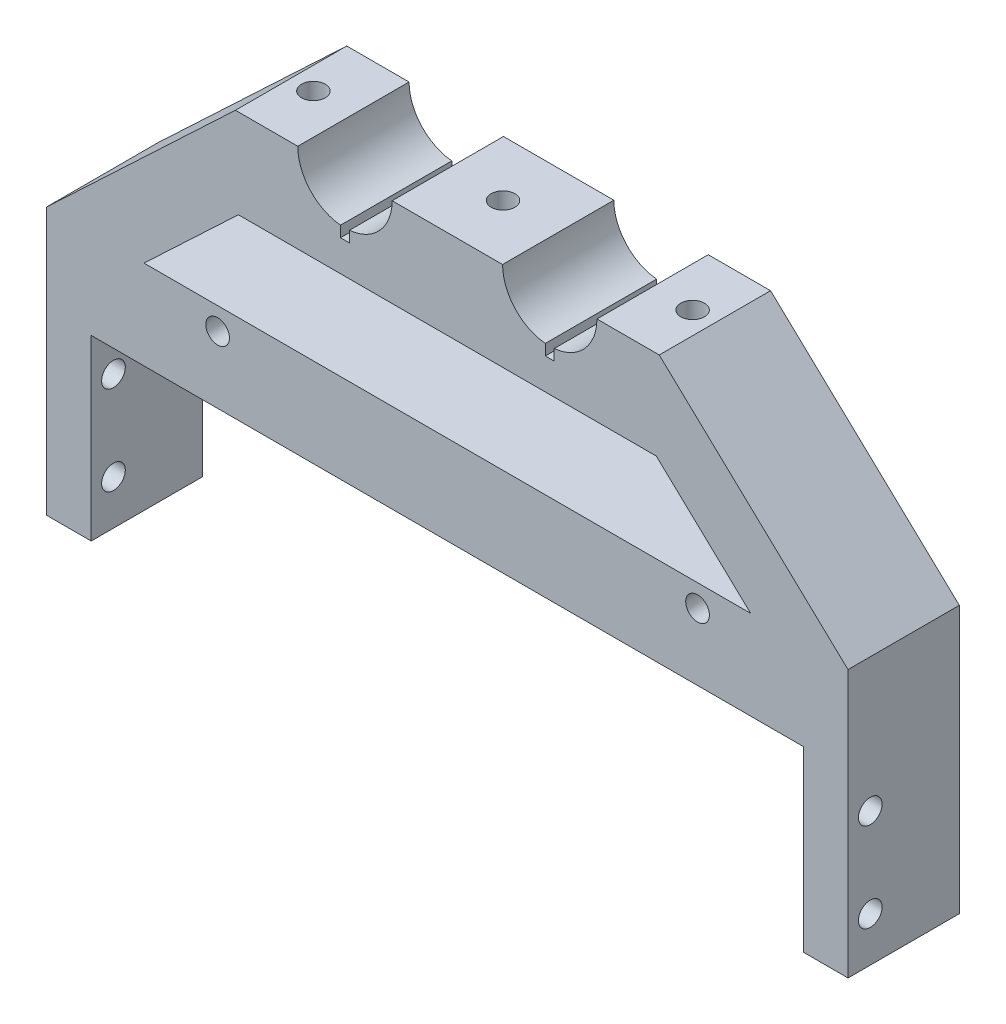
ISO-10303-21;
HEADER;
FILE_DESCRIPTION(('STEP AP214'),'2;1');
FILE_NAME('part.step','',(''),(''),'','','');
FILE_SCHEMA(('AUTOMOTIVE_DESIGN { 1 0 10303 214 1 1 1 1 }'));
ENDSEC;
DATA;
#1=APPLICATION_CONTEXT('core data for automotive mechanical design processes');
#2=APPLICATION_PROTOCOL_DEFINITION('international standard','automotive_design',2000,#1);
#3=PRODUCT_CONTEXT('',#1,'mechanical');
#4=PRODUCT('Part','Part','',(#3));
#5=PRODUCT_RELATED_PRODUCT_CATEGORY('part','',(#4));
#6=PRODUCT_DEFINITION_FORMATION('','',#4);
#7=PRODUCT_DEFINITION_CONTEXT('part definition',#1,'design');
#8=PRODUCT_DEFINITION('design','',#6,#7);
#9=PRODUCT_DEFINITION_SHAPE('','',#8);
#10=(LENGTH_UNIT() NAMED_UNIT(*) SI_UNIT(.MILLI.,.METRE.));
#11=(NAMED_UNIT(*) PLANE_ANGLE_UNIT() SI_UNIT($,.RADIAN.));
#12=(NAMED_UNIT(*) SI_UNIT($,.STERADIAN.) SOLID_ANGLE_UNIT());
#13=UNCERTAINTY_MEASURE_WITH_UNIT(LENGTH_MEASURE(1.E-05),#10,'distance_accuracy_value','');
#14=(GEOMETRIC_REPRESENTATION_CONTEXT(3) GLOBAL_UNCERTAINTY_ASSIGNED_CONTEXT((#13)) GLOBAL_UNIT_ASSIGNED_CONTEXT((#10,
#11,#12)) REPRESENTATION_CONTEXT('',''));
#15=CARTESIAN_POINT('',(0.,0.,0.));
#16=DIRECTION('',(0.,0.,1.));
#17=DIRECTION('',(1.,0.,0.));
#18=AXIS2_PLACEMENT_3D('',#15,#16,#17);
#19=CARTESIAN_POINT('',(143.51,152.4,50.8));
#20=DIRECTION('',(0.,0.,-1.));
#21=DIRECTION('',(-1.,0.,0.));
#22=AXIS2_PLACEMENT_3D('',#19,#20,#21);
#23=CYLINDRICAL_SURFACE('',#22,13.462);
#24=CARTESIAN_POINT('',(143.51,152.4,0.));
#25=DIRECTION('',(0.,0.,-1.));
#26=DIRECTION('',(1.,0.,0.));
#27=AXIS2_PLACEMENT_3D('',#24,#25,#26);
#28=CIRCLE('',#27,13.462);
#29=CARTESIAN_POINT('',(156.972,152.4,0.));
#30=VERTEX_POINT('',#29);
#31=CARTESIAN_POINT('',(144.78,138.998039546395,0.));
#32=VERTEX_POINT('',#31);
#33=EDGE_CURVE('E400',#30,#32,#28,.T.);
#34=ORIENTED_EDGE('',*,*,#33,.T.);
#35=DIRECTION('',(0.,0.,-1.));
#36=VECTOR('',#35,1.);
#37=CARTESIAN_POINT('',(144.78,138.998039546395,50.8));
#38=LINE('',#37,#36);
#39=CARTESIAN_POINT('',(144.78,138.998039546395,31.7499999999999));
#40=VERTEX_POINT('',#39);
#41=EDGE_CURVE('E262',#32,#40,#38,.F.);
#42=ORIENTED_EDGE('',*,*,#41,.T.);
#43=CARTESIAN_POINT('',(143.51,152.4,31.75));
#44=DIRECTION('',(0.,0.,-1.));
#45=DIRECTION('',(-1.,0.,0.));
#46=AXIS2_PLACEMENT_3D('',#43,#44,#45);
#47=CIRCLE('',#46,13.462);
#48=CARTESIAN_POINT('',(156.972,152.4,31.75));
#49=VERTEX_POINT('',#48);
#50=EDGE_CURVE('E345',#40,#49,#47,.F.);
#51=ORIENTED_EDGE('',*,*,#50,.T.);
#52=DIRECTION('',(0.,0.,-1.));
#53=VECTOR('',#52,1.);
#54=CARTESIAN_POINT('',(156.972,152.4,50.8));
#55=LINE('',#54,#53);
#56=EDGE_CURVE('E428',#49,#30,#55,.T.);
#57=ORIENTED_EDGE('',*,*,#56,.T.);
#58=EDGE_LOOP('',(#34,#42,#51,#57));
#59=FACE_BOUND('',#58,.T.);
#60=ADVANCED_FACE('F38',(#59),#23,.F.);
#61=CARTESIAN_POINT('',(85.09,152.4,50.8));
#62=DIRECTION('',(0.,0.,-1.));
#63=DIRECTION('',(-1.,0.,0.));
#64=AXIS2_PLACEMENT_3D('',#61,#62,#63);
#65=CYLINDRICAL_SURFACE('',#64,13.462);
#66=DIRECTION('',(0.,0.,-1.));
#67=VECTOR('',#66,1.);
#68=CARTESIAN_POINT('',(83.82,138.998039546395,50.8));
#69=LINE('',#68,#67);
#70=CARTESIAN_POINT('',(83.82,138.998039546395,0.));
#71=VERTEX_POINT('',#70);
#72=CARTESIAN_POINT('',(83.82,138.998039546395,31.75));
#73=VERTEX_POINT('',#72);
#74=EDGE_CURVE('E267',#71,#73,#69,.F.);
#75=ORIENTED_EDGE('',*,*,#74,.F.);
#76=CARTESIAN_POINT('',(85.09,152.4,0.));
#77=DIRECTION('',(0.,0.,-1.));
#78=DIRECTION('',(1.,0.,0.));
#79=AXIS2_PLACEMENT_3D('',#76,#77,#78);
#80=CIRCLE('',#79,13.462);
#81=CARTESIAN_POINT('',(71.628,152.4,0.));
#82=VERTEX_POINT('',#81);
#83=EDGE_CURVE('E406',#71,#82,#80,.T.);
#84=ORIENTED_EDGE('',*,*,#83,.T.);
#85=DIRECTION('',(0.,0.,-1.));
#86=VECTOR('',#85,1.);
#87=CARTESIAN_POINT('',(71.628,152.4,50.8));
#88=LINE('',#87,#86);
#89=CARTESIAN_POINT('',(71.628,152.4,31.75));
#90=VERTEX_POINT('',#89);
#91=EDGE_CURVE('E420',#90,#82,#88,.T.);
#92=ORIENTED_EDGE('',*,*,#91,.F.);
#93=CARTESIAN_POINT('',(85.09,152.4,31.75));
#94=DIRECTION('',(0.,0.,-1.));
#95=DIRECTION('',(-1.,0.,0.));
#96=AXIS2_PLACEMENT_3D('',#93,#94,#95);
#97=CIRCLE('',#96,13.462);
#98=EDGE_CURVE('E342',#90,#73,#97,.F.);
#99=ORIENTED_EDGE('',*,*,#98,.T.);
#100=EDGE_LOOP('',(#75,#84,#92,#99));
#101=FACE_BOUND('',#100,.T.);
#102=ADVANCED_FACE('F511',(#101),#65,.F.);
#103=DIRECTION('',(0.,0.,-1.));
#104=VECTOR('',#103,1.);
#105=CARTESIAN_POINT('',(86.36,138.998039546395,50.8));
#106=LINE('',#105,#104);
#107=CARTESIAN_POINT('',(86.36,138.998039546395,31.75));
#108=VERTEX_POINT('',#107);
#109=CARTESIAN_POINT('',(86.36,138.998039546395,0.));
#110=VERTEX_POINT('',#109);
#111=EDGE_CURVE('E265',#108,#110,#106,.T.);
#112=ORIENTED_EDGE('',*,*,#111,.F.);
#113=CARTESIAN_POINT('',(98.5519999999999,152.4,31.75));
#114=VERTEX_POINT('',#113);
#115=EDGE_CURVE('E234',#108,#114,#97,.F.);
#116=ORIENTED_EDGE('',*,*,#115,.T.);
#117=DIRECTION('',(0.,0.,-1.));
#118=VECTOR('',#117,1.);
#119=CARTESIAN_POINT('',(98.5519999999999,152.4,50.8));
#120=LINE('',#119,#118);
#121=CARTESIAN_POINT('',(98.5519999999999,152.4,0.));
#122=VERTEX_POINT('',#121);
#123=EDGE_CURVE('E423',#114,#122,#120,.T.);
#124=ORIENTED_EDGE('',*,*,#123,.T.);
#125=EDGE_CURVE('E407',#122,#110,#80,.T.);
#126=ORIENTED_EDGE('',*,*,#125,.T.);
#127=EDGE_LOOP('',(#112,#116,#124,#126));
#128=FACE_BOUND('',#127,.T.);
#129=ADVANCED_FACE('F505',(#128),#65,.F.);
#130=CARTESIAN_POINT('',(85.09,152.4,0.));
#131=DIRECTION('',(0.,0.,1.));
#132=DIRECTION('',(1.,0.,0.));
#133=AXIS2_PLACEMENT_3D('',#130,#131,#132);
#134=PLANE('',#133);
#135=CARTESIAN_POINT('',(48.768,95.25,0.));
#136=DIRECTION('',(0.,0.,1.));
#137=DIRECTION('',(1.,0.,0.));
#138=AXIS2_PLACEMENT_3D('',#135,#136,#137);
#139=CIRCLE('',#138,3.37819999999999);
#140=CARTESIAN_POINT('',(52.1462,95.25,0.));
#141=VERTEX_POINT('',#140);
#142=EDGE_CURVE('E252',#141,#141,#139,.F.);
#143=ORIENTED_EDGE('',*,*,#142,.F.);
#144=EDGE_LOOP('',(#143));
#145=FACE_BOUND('',#144,.T.);
#146=CARTESIAN_POINT('',(185.674,95.25,0.));
#147=DIRECTION('',(0.,0.,1.));
#148=DIRECTION('',(1.,0.,0.));
#149=AXIS2_PLACEMENT_3D('',#146,#147,#148);
#150=CIRCLE('',#149,3.37819999999999);
#151=CARTESIAN_POINT('',(189.0522,95.25,0.));
#152=VERTEX_POINT('',#151);
#153=EDGE_CURVE('E578',#152,#152,#150,.F.);
#154=ORIENTED_EDGE('',*,*,#153,.F.);
#155=EDGE_LOOP('',(#154));
#156=FACE_BOUND('',#155,.T.);
#157=DIRECTION('',(-0.727393652509463,0.686220426895719,0.));
#158=VECTOR('',#157,1.);
#159=CARTESIAN_POINT('',(114.239199869332,183.298151861492,0.));
#160=LINE('',#159,#158);
#161=CARTESIAN_POINT('',(200.839240842513,101.6,0.));
#162=VERTEX_POINT('',#161);
#163=CARTESIAN_POINT('',(173.915240842513,127.,0.));
#164=VERTEX_POINT('',#163);
#165=EDGE_CURVE('E304',#162,#164,#160,.T.);
#166=ORIENTED_EDGE('',*,*,#165,.T.);
#167=DIRECTION('',(-1.,0.,0.));
#168=VECTOR('',#167,1.);
#169=CARTESIAN_POINT('',(85.09,127.,0.));
#170=LINE('',#169,#168);
#171=CARTESIAN_POINT('',(54.6847591574871,127.,0.));
#172=VERTEX_POINT('',#171);
#173=EDGE_CURVE('E295',#164,#172,#170,.T.);
#174=ORIENTED_EDGE('',*,*,#173,.T.);
#175=DIRECTION('',(-0.727393652509463,-0.686220426895719,0.));
#176=VECTOR('',#175,1.);
#177=CARTESIAN_POINT('',(83.4506889986283,154.137669661454,0.));
#178=LINE('',#177,#176);
#179=CARTESIAN_POINT('',(27.760759157487,101.6,0.));
#180=VERTEX_POINT('',#179);
#181=EDGE_CURVE('E298',#172,#180,#178,.T.);
#182=ORIENTED_EDGE('',*,*,#181,.T.);
#183=DIRECTION('',(1.,0.,0.));
#184=VECTOR('',#183,1.);
#185=CARTESIAN_POINT('',(85.09,101.6,0.));
#186=LINE('',#185,#184);
#187=EDGE_CURVE('E301',#180,#162,#186,.T.);
#188=ORIENTED_EDGE('',*,*,#187,.T.);
#189=EDGE_LOOP('',(#166,#174,#182,#188));
#190=FACE_BOUND('',#189,.T.);
#191=DIRECTION('',(0.,1.,0.));
#192=VECTOR('',#191,1.);
#193=CARTESIAN_POINT('',(83.82,135.89,0.));
#194=LINE('',#193,#192);
#195=CARTESIAN_POINT('',(83.82,135.89,0.));
#196=VERTEX_POINT('',#195);
#197=EDGE_CURVE('E236',#196,#71,#194,.T.);
#198=ORIENTED_EDGE('',*,*,#197,.F.);
#199=DIRECTION('',(1.,0.,0.));
#200=VECTOR('',#199,1.);
#201=CARTESIAN_POINT('',(0.,135.89,0.));
#202=LINE('',#201,#200);
#203=CARTESIAN_POINT('',(86.36,135.89,0.));
#204=VERTEX_POINT('',#203);
#205=EDGE_CURVE('E222',#196,#204,#202,.T.);
#206=ORIENTED_EDGE('',*,*,#205,.T.);
#207=DIRECTION('',(0.,1.,0.));
#208=VECTOR('',#207,1.);
#209=CARTESIAN_POINT('',(86.36,135.89,0.));
#210=LINE('',#209,#208);
#211=EDGE_CURVE('E218',#204,#110,#210,.T.);
#212=ORIENTED_EDGE('',*,*,#211,.T.);
#213=ORIENTED_EDGE('',*,*,#125,.F.);
#214=DIRECTION('',(-1.,0.,0.));
#215=VECTOR('',#214,1.);
#216=CARTESIAN_POINT('',(98.5519999999999,152.4,0.));
#217=LINE('',#216,#215);
#218=CARTESIAN_POINT('',(130.048,152.4,0.));
#219=VERTEX_POINT('',#218);
#220=EDGE_CURVE('E403',#219,#122,#217,.T.);
#221=ORIENTED_EDGE('',*,*,#220,.F.);
#222=CARTESIAN_POINT('',(142.24,138.998039546395,0.));
#223=VERTEX_POINT('',#222);
#224=EDGE_CURVE('E399',#223,#219,#28,.T.);
#225=ORIENTED_EDGE('',*,*,#224,.F.);
#226=DIRECTION('',(0.,1.,0.));
#227=VECTOR('',#226,1.);
#228=CARTESIAN_POINT('',(142.24,135.89,0.));
#229=LINE('',#228,#227);
#230=CARTESIAN_POINT('',(142.24,135.89,0.));
#231=VERTEX_POINT('',#230);
#232=EDGE_CURVE('E241',#231,#223,#229,.T.);
#233=ORIENTED_EDGE('',*,*,#232,.F.);
#234=DIRECTION('',(-1.,0.,0.));
#235=VECTOR('',#234,1.);
#236=CARTESIAN_POINT('',(144.78,135.89,0.));
#237=LINE('',#236,#235);
#238=CARTESIAN_POINT('',(144.78,135.89,0.));
#239=VERTEX_POINT('',#238);
#240=EDGE_CURVE('E229',#239,#231,#237,.T.);
#241=ORIENTED_EDGE('',*,*,#240,.F.);
#242=DIRECTION('',(0.,1.,0.));
#243=VECTOR('',#242,1.);
#244=CARTESIAN_POINT('',(144.78,135.89,0.));
#245=LINE('',#244,#243);
#246=EDGE_CURVE('E249',#239,#32,#245,.T.);
#247=ORIENTED_EDGE('',*,*,#246,.T.);
#248=ORIENTED_EDGE('',*,*,#33,.F.);
#249=DIRECTION('',(-1.,0.,0.));
#250=VECTOR('',#249,1.);
#251=CARTESIAN_POINT('',(156.972,152.4,0.));
#252=LINE('',#251,#250);
#253=CARTESIAN_POINT('',(174.752,152.4,0.));
#254=VERTEX_POINT('',#253);
#255=EDGE_CURVE('E396',#254,#30,#252,.T.);
#256=ORIENTED_EDGE('',*,*,#255,.F.);
#257=DIRECTION('',(-0.727393652509463,0.686220426895719,0.));
#258=VECTOR('',#257,1.);
#259=CARTESIAN_POINT('',(228.6,101.6,0.));
#260=LINE('',#259,#258);
#261=CARTESIAN_POINT('',(228.6,101.6,0.));
#262=VERTEX_POINT('',#261);
#263=EDGE_CURVE('E393',#262,#254,#260,.T.);
#264=ORIENTED_EDGE('',*,*,#263,.F.);
#265=DIRECTION('',(0.,1.,0.));
#266=VECTOR('',#265,1.);
#267=CARTESIAN_POINT('',(228.6,0.,0.));
#268=LINE('',#267,#266);
#269=CARTESIAN_POINT('',(228.6,25.4,0.));
#270=VERTEX_POINT('',#269);
#271=EDGE_CURVE('E391',#270,#262,#268,.T.);
#272=ORIENTED_EDGE('',*,*,#271,.F.);
#273=DIRECTION('',(-1.,0.,0.));
#274=VECTOR('',#273,1.);
#275=CARTESIAN_POINT('',(85.09,25.4,0.));
#276=LINE('',#275,#274);
#277=CARTESIAN_POINT('',(215.9,25.4,0.));
#278=VERTEX_POINT('',#277);
#279=EDGE_CURVE('E327',#270,#278,#276,.T.);
#280=ORIENTED_EDGE('',*,*,#279,.T.);
#281=DIRECTION('',(0.,-1.,0.));
#282=VECTOR('',#281,1.);
#283=CARTESIAN_POINT('',(215.9,76.2,0.));
#284=LINE('',#283,#282);
#285=CARTESIAN_POINT('',(215.9,76.2,0.));
#286=VERTEX_POINT('',#285);
#287=EDGE_CURVE('E388',#286,#278,#284,.T.);
#288=ORIENTED_EDGE('',*,*,#287,.F.);
#289=DIRECTION('',(1.,0.,0.));
#290=VECTOR('',#289,1.);
#291=CARTESIAN_POINT('',(12.7,76.2,0.));
#292=LINE('',#291,#290);
#293=CARTESIAN_POINT('',(12.7,76.2,0.));
#294=VERTEX_POINT('',#293);
#295=EDGE_CURVE('E385',#294,#286,#292,.T.);
#296=ORIENTED_EDGE('',*,*,#295,.F.);
#297=DIRECTION('',(0.,1.,0.));
#298=VECTOR('',#297,1.);
#299=CARTESIAN_POINT('',(12.7,0.,0.));
#300=LINE('',#299,#298);
#301=CARTESIAN_POINT('',(12.7,25.4,0.));
#302=VERTEX_POINT('',#301);
#303=EDGE_CURVE('E382',#302,#294,#300,.T.);
#304=ORIENTED_EDGE('',*,*,#303,.F.);
#305=CARTESIAN_POINT('',(0.,25.4,0.));
#306=VERTEX_POINT('',#305);
#307=EDGE_CURVE('E322',#302,#306,#276,.T.);
#308=ORIENTED_EDGE('',*,*,#307,.T.);
#309=DIRECTION('',(0.,-1.,0.));
#310=VECTOR('',#309,1.);
#311=CARTESIAN_POINT('',(0.,0.,0.));
#312=LINE('',#311,#310);
#313=CARTESIAN_POINT('',(0.,101.6,0.));
#314=VERTEX_POINT('',#313);
#315=EDGE_CURVE('E379',#314,#306,#312,.T.);
#316=ORIENTED_EDGE('',*,*,#315,.F.);
#317=DIRECTION('',(-0.727393652509463,-0.686220426895719,0.));
#318=VECTOR('',#317,1.);
#319=CARTESIAN_POINT('',(0.,101.6,0.));
#320=LINE('',#319,#318);
#321=CARTESIAN_POINT('',(53.848,152.4,0.));
#322=VERTEX_POINT('',#321);
#323=EDGE_CURVE('E413',#322,#314,#320,.T.);
#324=ORIENTED_EDGE('',*,*,#323,.F.);
#325=DIRECTION('',(-1.,0.,0.));
#326=VECTOR('',#325,1.);
#327=CARTESIAN_POINT('',(53.848,152.4,0.));
#328=LINE('',#327,#326);
#329=EDGE_CURVE('E410',#82,#322,#328,.T.);
#330=ORIENTED_EDGE('',*,*,#329,.F.);
#331=ORIENTED_EDGE('',*,*,#83,.F.);
#332=EDGE_LOOP('',(#198,#206,#212,#213,#221,#225,#233,#241,#247,#248,#256,#264,#272,#280,#288,
#296,#304,#308,#316,#324,#330,#331));
#333=FACE_BOUND('',#332,.T.);
#334=ADVANCED_FACE('F460',(#145,#156,#190,#333),#134,.F.);
#335=CARTESIAN_POINT('',(0.,0.,31.75));
#336=DIRECTION('',(0.,0.,-1.));
#337=DIRECTION('',(-1.,0.,0.));
#338=AXIS2_PLACEMENT_3D('',#335,#336,#337);
#339=PLANE('',#338);
#340=CARTESIAN_POINT('',(48.768,95.25,31.75));
#341=DIRECTION('',(0.,0.,1.));
#342=DIRECTION('',(1.,0.,0.));
#343=AXIS2_PLACEMENT_3D('',#340,#341,#342);
#344=CIRCLE('',#343,3.37819999999999);
#345=CARTESIAN_POINT('',(52.1462,95.25,31.75));
#346=VERTEX_POINT('',#345);
#347=EDGE_CURVE('E800',#346,#346,#344,.T.);
#348=ORIENTED_EDGE('',*,*,#347,.F.);
#349=EDGE_LOOP('',(#348));
#350=FACE_BOUND('',#349,.T.);
#351=CARTESIAN_POINT('',(185.674,95.25,31.75));
#352=DIRECTION('',(0.,0.,1.));
#353=DIRECTION('',(1.,0.,0.));
#354=AXIS2_PLACEMENT_3D('',#351,#352,#353);
#355=CIRCLE('',#354,3.37819999999999);
#356=CARTESIAN_POINT('',(189.0522,95.25,31.75));
#357=VERTEX_POINT('',#356);
#358=EDGE_CURVE('E804',#357,#357,#355,.T.);
#359=ORIENTED_EDGE('',*,*,#358,.F.);
#360=EDGE_LOOP('',(#359));
#361=FACE_BOUND('',#360,.T.);
#362=DIRECTION('',(-0.727393652509463,-0.686220426895719,0.));
#363=VECTOR('',#362,1.);
#364=CARTESIAN_POINT('',(27.760759157487,101.6,31.75));
#365=LINE('',#364,#363);
#366=CARTESIAN_POINT('',(54.6847591574871,127.,31.75));
#367=VERTEX_POINT('',#366);
#368=CARTESIAN_POINT('',(27.760759157487,101.6,31.75));
#369=VERTEX_POINT('',#368);
#370=EDGE_CURVE('E271',#367,#369,#365,.T.);
#371=ORIENTED_EDGE('',*,*,#370,.F.);
#372=DIRECTION('',(-1.,0.,0.));
#373=VECTOR('',#372,1.);
#374=CARTESIAN_POINT('',(54.6847591574871,127.,31.75));
#375=LINE('',#374,#373);
#376=CARTESIAN_POINT('',(173.915240842513,127.,31.75));
#377=VERTEX_POINT('',#376);
#378=EDGE_CURVE('E269',#377,#367,#375,.T.);
#379=ORIENTED_EDGE('',*,*,#378,.F.);
#380=DIRECTION('',(-0.727393652509462,0.686220426895719,0.));
#381=VECTOR('',#380,1.);
#382=CARTESIAN_POINT('',(173.915240842513,127.,31.75));
#383=LINE('',#382,#381);
#384=CARTESIAN_POINT('',(200.839240842513,101.6,31.75));
#385=VERTEX_POINT('',#384);
#386=EDGE_CURVE('E277',#385,#377,#383,.T.);
#387=ORIENTED_EDGE('',*,*,#386,.F.);
#388=DIRECTION('',(1.,0.,0.));
#389=VECTOR('',#388,1.);
#390=CARTESIAN_POINT('',(27.760759157487,101.6,31.75));
#391=LINE('',#390,#389);
#392=EDGE_CURVE('E274',#369,#385,#391,.T.);
#393=ORIENTED_EDGE('',*,*,#392,.F.);
#394=EDGE_LOOP('',(#371,#379,#387,#393));
#395=FACE_BOUND('',#394,.T.);
#396=DIRECTION('',(0.,1.,0.));
#397=VECTOR('',#396,1.);
#398=CARTESIAN_POINT('',(83.82,135.89,31.75));
#399=LINE('',#398,#397);
#400=CARTESIAN_POINT('',(83.82,135.89,31.75));
#401=VERTEX_POINT('',#400);
#402=EDGE_CURVE('E54',#401,#73,#399,.T.);
#403=ORIENTED_EDGE('',*,*,#402,.T.);
#404=ORIENTED_EDGE('',*,*,#98,.F.);
#405=DIRECTION('',(-1.,0.,0.));
#406=VECTOR('',#405,1.);
#407=CARTESIAN_POINT('',(0.,152.4,31.75));
#408=LINE('',#407,#406);
#409=CARTESIAN_POINT('',(53.848,152.4,31.75));
#410=VERTEX_POINT('',#409);
#411=EDGE_CURVE('E338',#90,#410,#408,.T.);
#412=ORIENTED_EDGE('',*,*,#411,.T.);
#413=DIRECTION('',(0.727393652509463,0.686220426895719,0.));
#414=VECTOR('',#413,1.);
#415=CARTESIAN_POINT('',(0.,101.6,31.75));
#416=LINE('',#415,#414);
#417=CARTESIAN_POINT('',(0.,101.6,31.75));
#418=VERTEX_POINT('',#417);
#419=EDGE_CURVE('E47',#418,#410,#416,.T.);
#420=ORIENTED_EDGE('',*,*,#419,.F.);
#421=DIRECTION('',(0.,-1.,0.));
#422=VECTOR('',#421,1.);
#423=CARTESIAN_POINT('',(0.,0.,31.75));
#424=LINE('',#423,#422);
#425=CARTESIAN_POINT('',(0.,25.4,31.75));
#426=VERTEX_POINT('',#425);
#427=EDGE_CURVE('E333',#418,#426,#424,.T.);
#428=ORIENTED_EDGE('',*,*,#427,.T.);
#429=DIRECTION('',(1.,0.,0.));
#430=VECTOR('',#429,1.);
#431=CARTESIAN_POINT('',(0.,25.4,31.75));
#432=LINE('',#431,#430);
#433=CARTESIAN_POINT('',(12.7,25.4,31.75));
#434=VERTEX_POINT('',#433);
#435=EDGE_CURVE('E12',#426,#434,#432,.T.);
#436=ORIENTED_EDGE('',*,*,#435,.T.);
#437=DIRECTION('',(0.,-1.,0.));
#438=VECTOR('',#437,1.);
#439=CARTESIAN_POINT('',(12.7,0.,31.75));
#440=LINE('',#439,#438);
#441=CARTESIAN_POINT('',(12.7,76.2,31.75));
#442=VERTEX_POINT('',#441);
#443=EDGE_CURVE('E357',#442,#434,#440,.T.);
#444=ORIENTED_EDGE('',*,*,#443,.F.);
#445=DIRECTION('',(-1.,0.,0.));
#446=VECTOR('',#445,1.);
#447=CARTESIAN_POINT('',(12.7,76.2,31.75));
#448=LINE('',#447,#446);
#449=CARTESIAN_POINT('',(215.9,76.2,31.75));
#450=VERTEX_POINT('',#449);
#451=EDGE_CURVE('E354',#450,#442,#448,.T.);
#452=ORIENTED_EDGE('',*,*,#451,.F.);
#453=DIRECTION('',(0.,1.,0.));
#454=VECTOR('',#453,1.);
#455=CARTESIAN_POINT('',(215.9,76.2,31.75));
#456=LINE('',#455,#454);
#457=CARTESIAN_POINT('',(215.9,25.4,31.75));
#458=VERTEX_POINT('',#457);
#459=EDGE_CURVE('E352',#458,#450,#456,.T.);
#460=ORIENTED_EDGE('',*,*,#459,.F.);
#461=DIRECTION('',(-1.,0.,0.));
#462=VECTOR('',#461,1.);
#463=CARTESIAN_POINT('',(0.,25.4,31.75));
#464=LINE('',#463,#462);
#465=CARTESIAN_POINT('',(228.6,25.4,31.75));
#466=VERTEX_POINT('',#465);
#467=EDGE_CURVE('E311',#466,#458,#464,.T.);
#468=ORIENTED_EDGE('',*,*,#467,.F.);
#469=DIRECTION('',(0.,1.,0.));
#470=VECTOR('',#469,1.);
#471=CARTESIAN_POINT('',(228.6,0.,31.75));
#472=LINE('',#471,#470);
#473=CARTESIAN_POINT('',(228.6,101.6,31.75));
#474=VERTEX_POINT('',#473);
#475=EDGE_CURVE('E336',#466,#474,#472,.T.);
#476=ORIENTED_EDGE('',*,*,#475,.T.);
#477=DIRECTION('',(0.727393652509463,-0.686220426895719,0.));
#478=VECTOR('',#477,1.);
#479=CARTESIAN_POINT('',(228.6,101.6,31.75));
#480=LINE('',#479,#478);
#481=CARTESIAN_POINT('',(174.752,152.4,31.75));
#482=VERTEX_POINT('',#481);
#483=EDGE_CURVE('E349',#482,#474,#480,.T.);
#484=ORIENTED_EDGE('',*,*,#483,.F.);
#485=EDGE_CURVE('E341',#482,#49,#408,.T.);
#486=ORIENTED_EDGE('',*,*,#485,.T.);
#487=ORIENTED_EDGE('',*,*,#50,.F.);
#488=DIRECTION('',(0.,1.,0.));
#489=VECTOR('',#488,1.);
#490=CARTESIAN_POINT('',(144.78,135.89,31.7499999999999));
#491=LINE('',#490,#489);
#492=CARTESIAN_POINT('',(144.78,135.89,31.7499999999999));
#493=VERTEX_POINT('',#492);
#494=EDGE_CURVE('E247',#493,#40,#491,.T.);
#495=ORIENTED_EDGE('',*,*,#494,.F.);
#496=DIRECTION('',(1.,0.,0.));
#497=VECTOR('',#496,1.);
#498=CARTESIAN_POINT('',(142.24,135.89,31.7499999999999));
#499=LINE('',#498,#497);
#500=CARTESIAN_POINT('',(142.24,135.89,31.75));
#501=VERTEX_POINT('',#500);
#502=EDGE_CURVE('E255',#501,#493,#499,.T.);
#503=ORIENTED_EDGE('',*,*,#502,.F.);
#504=DIRECTION('',(0.,1.,0.));
#505=VECTOR('',#504,1.);
#506=CARTESIAN_POINT('',(142.24,135.89,31.7499999999999));
#507=LINE('',#506,#505);
#508=CARTESIAN_POINT('',(142.24,138.998039546395,31.7499999999999));
#509=VERTEX_POINT('',#508);
#510=EDGE_CURVE('E244',#501,#509,#507,.T.);
#511=ORIENTED_EDGE('',*,*,#510,.T.);
#512=CARTESIAN_POINT('',(130.048,152.4,31.75));
#513=VERTEX_POINT('',#512);
#514=EDGE_CURVE('E346',#513,#509,#47,.F.);
#515=ORIENTED_EDGE('',*,*,#514,.F.);
#516=EDGE_CURVE('E340',#513,#114,#408,.T.);
#517=ORIENTED_EDGE('',*,*,#516,.T.);
#518=ORIENTED_EDGE('',*,*,#115,.F.);
#519=DIRECTION('',(0.,1.,0.));
#520=VECTOR('',#519,1.);
#521=CARTESIAN_POINT('',(86.36,135.89,31.75));
#522=LINE('',#521,#520);
#523=CARTESIAN_POINT('',(86.36,135.89,31.75));
#524=VERTEX_POINT('',#523);
#525=EDGE_CURVE('E215',#524,#108,#522,.T.);
#526=ORIENTED_EDGE('',*,*,#525,.F.);
#527=DIRECTION('',(-1.,0.,0.));
#528=VECTOR('',#527,1.);
#529=CARTESIAN_POINT('',(0.,135.89,31.75));
#530=LINE('',#529,#528);
#531=EDGE_CURVE('E223',#524,#401,#530,.T.);
#532=ORIENTED_EDGE('',*,*,#531,.T.);
#533=EDGE_LOOP('',(#403,#404,#412,#420,#428,#436,#444,#452,#460,#468,#476,#484,#486,#487,#495,
#503,#511,#515,#517,#518,#526,#532));
#534=FACE_BOUND('',#533,.T.);
#535=ADVANCED_FACE('F232',(#350,#361,#395,#534),#339,.F.);
#536=CARTESIAN_POINT('',(0.,0.,50.8));
#537=DIRECTION('',(1.,0.,0.));
#538=DIRECTION('',(0.,0.,-1.));
#539=AXIS2_PLACEMENT_3D('',#536,#537,#538);
#540=PLANE('',#539);
#541=CARTESIAN_POINT('',(0.,63.5,25.4));
#542=DIRECTION('',(-1.,0.,0.));
#543=DIRECTION('',(0.,0.,1.));
#544=AXIS2_PLACEMENT_3D('',#541,#542,#543);
#545=CIRCLE('',#544,3.3782);
#546=CARTESIAN_POINT('',(0.,63.5,28.7782));
#547=VERTEX_POINT('',#546);
#548=EDGE_CURVE('E373',#547,#547,#545,.T.);
#549=ORIENTED_EDGE('',*,*,#548,.F.);
#550=EDGE_LOOP('',(#549));
#551=FACE_BOUND('',#550,.T.);
#552=CARTESIAN_POINT('',(0.,38.1,25.4));
#553=DIRECTION('',(-1.,0.,0.));
#554=DIRECTION('',(0.,0.,1.));
#555=AXIS2_PLACEMENT_3D('',#552,#553,#554);
#556=CIRCLE('',#555,3.3782);
#557=CARTESIAN_POINT('',(0.,38.1,28.7782));
#558=VERTEX_POINT('',#557);
#559=EDGE_CURVE('E372',#558,#558,#556,.T.);
#560=ORIENTED_EDGE('',*,*,#559,.F.);
#561=EDGE_LOOP('',(#560));
#562=FACE_BOUND('',#561,.T.);
#563=ORIENTED_EDGE('',*,*,#315,.T.);
#564=DIRECTION('',(0.,0.,1.));
#565=VECTOR('',#564,1.);
#566=CARTESIAN_POINT('',(0.,25.4,-7.62));
#567=LINE('',#566,#565);
#568=EDGE_CURVE('E319',#306,#426,#567,.T.);
#569=ORIENTED_EDGE('',*,*,#568,.T.);
#570=ORIENTED_EDGE('',*,*,#427,.F.);
#571=DIRECTION('',(0.,0.,-1.));
#572=VECTOR('',#571,1.);
#573=CARTESIAN_POINT('',(0.,101.6,50.8));
#574=LINE('',#573,#572);
#575=EDGE_CURVE('E416',#418,#314,#574,.T.);
#576=ORIENTED_EDGE('',*,*,#575,.T.);
#577=EDGE_LOOP('',(#563,#569,#570,#576));
#578=FACE_BOUND('',#577,.T.);
#579=ADVANCED_FACE('F40',(#551,#562,#578),#540,.F.);
#580=CARTESIAN_POINT('',(12.7,0.,50.8));
#581=DIRECTION('',(-1.,0.,0.));
#582=DIRECTION('',(0.,0.,1.));
#583=AXIS2_PLACEMENT_3D('',#580,#581,#582);
#584=PLANE('',#583);
#585=CARTESIAN_POINT('',(12.7,63.5,25.4));
#586=DIRECTION('',(-1.,0.,0.));
#587=DIRECTION('',(0.,0.,1.));
#588=AXIS2_PLACEMENT_3D('',#585,#586,#587);
#589=CIRCLE('',#588,3.3782);
#590=CARTESIAN_POINT('',(12.7,63.5,28.7782));
#591=VERTEX_POINT('',#590);
#592=EDGE_CURVE('E383',#591,#591,#589,.T.);
#593=ORIENTED_EDGE('',*,*,#592,.T.);
#594=EDGE_LOOP('',(#593));
#595=FACE_BOUND('',#594,.T.);
#596=CARTESIAN_POINT('',(12.7,38.1,25.4));
#597=DIRECTION('',(-1.,0.,0.));
#598=DIRECTION('',(0.,0.,1.));
#599=AXIS2_PLACEMENT_3D('',#596,#597,#598);
#600=CIRCLE('',#599,3.3782);
#601=CARTESIAN_POINT('',(12.7,38.1,28.7782));
#602=VERTEX_POINT('',#601);
#603=EDGE_CURVE('E376',#602,#602,#600,.T.);
#604=ORIENTED_EDGE('',*,*,#603,.T.);
#605=EDGE_LOOP('',(#604));
#606=FACE_BOUND('',#605,.T.);
#607=ORIENTED_EDGE('',*,*,#443,.T.);
#608=DIRECTION('',(0.,0.,-1.));
#609=VECTOR('',#608,1.);
#610=CARTESIAN_POINT('',(12.7,25.4,50.8));
#611=LINE('',#610,#609);
#612=EDGE_CURVE('E326',#434,#302,#611,.T.);
#613=ORIENTED_EDGE('',*,*,#612,.T.);
#614=ORIENTED_EDGE('',*,*,#303,.T.);
#615=DIRECTION('',(0.,0.,-1.));
#616=VECTOR('',#615,1.);
#617=CARTESIAN_POINT('',(12.7,76.2,50.8));
#618=LINE('',#617,#616);
#619=EDGE_CURVE('E437',#442,#294,#618,.T.);
#620=ORIENTED_EDGE('',*,*,#619,.F.);
#621=EDGE_LOOP('',(#607,#613,#614,#620));
#622=FACE_BOUND('',#621,.T.);
#623=ADVANCED_FACE('F467',(#595,#606,#622),#584,.F.);
#624=CARTESIAN_POINT('',(12.7,76.2,50.8));
#625=DIRECTION('',(0.,1.,0.));
#626=DIRECTION('',(0.,0.,1.));
#627=AXIS2_PLACEMENT_3D('',#624,#625,#626);
#628=PLANE('',#627);
#629=DIRECTION('',(0.,0.,-1.));
#630=VECTOR('',#629,1.);
#631=CARTESIAN_POINT('',(215.9,76.2,50.8));
#632=LINE('',#631,#630);
#633=EDGE_CURVE('E435',#450,#286,#632,.T.);
#634=ORIENTED_EDGE('',*,*,#633,.F.);
#635=ORIENTED_EDGE('',*,*,#451,.T.);
#636=ORIENTED_EDGE('',*,*,#619,.T.);
#637=ORIENTED_EDGE('',*,*,#295,.T.);
#638=EDGE_LOOP('',(#634,#635,#636,#637));
#639=FACE_BOUND('',#638,.T.);
#640=ADVANCED_FACE('F471',(#639),#628,.F.);
#641=CARTESIAN_POINT('',(215.9,76.2,50.8));
#642=DIRECTION('',(1.,0.,0.));
#643=DIRECTION('',(0.,1.,0.));
#644=AXIS2_PLACEMENT_3D('',#641,#642,#643);
#645=PLANE('',#644);
#646=CARTESIAN_POINT('',(215.9,63.5,25.4));
#647=DIRECTION('',(1.,0.,0.));
#648=DIRECTION('',(0.,1.,0.));
#649=AXIS2_PLACEMENT_3D('',#646,#647,#648);
#650=CIRCLE('',#649,3.3782);
#651=CARTESIAN_POINT('',(215.9,66.8782,25.4));
#652=VERTEX_POINT('',#651);
#653=EDGE_CURVE('E369',#652,#652,#650,.T.);
#654=ORIENTED_EDGE('',*,*,#653,.T.);
#655=EDGE_LOOP('',(#654));
#656=FACE_BOUND('',#655,.T.);
#657=CARTESIAN_POINT('',(215.9,38.1,25.4));
#658=DIRECTION('',(1.,0.,0.));
#659=DIRECTION('',(0.,1.,0.));
#660=AXIS2_PLACEMENT_3D('',#657,#658,#659);
#661=CIRCLE('',#660,3.3782);
#662=CARTESIAN_POINT('',(215.9,41.4782,25.4));
#663=VERTEX_POINT('',#662);
#664=EDGE_CURVE('E364',#663,#663,#661,.T.);
#665=ORIENTED_EDGE('',*,*,#664,.T.);
#666=EDGE_LOOP('',(#665));
#667=FACE_BOUND('',#666,.T.);
#668=ORIENTED_EDGE('',*,*,#287,.T.);
#669=DIRECTION('',(0.,0.,1.));
#670=VECTOR('',#669,1.);
#671=CARTESIAN_POINT('',(215.9,25.4,50.8));
#672=LINE('',#671,#670);
#673=EDGE_CURVE('E330',#278,#458,#672,.T.);
#674=ORIENTED_EDGE('',*,*,#673,.T.);
#675=ORIENTED_EDGE('',*,*,#459,.T.);
#676=ORIENTED_EDGE('',*,*,#633,.T.);
#677=EDGE_LOOP('',(#668,#674,#675,#676));
#678=FACE_BOUND('',#677,.T.);
#679=ADVANCED_FACE('F476',(#656,#667,#678),#645,.F.);
#680=CARTESIAN_POINT('',(228.6,0.,50.8));
#681=DIRECTION('',(-1.,0.,0.));
#682=DIRECTION('',(0.,0.,1.));
#683=AXIS2_PLACEMENT_3D('',#680,#681,#682);
#684=PLANE('',#683);
#685=CARTESIAN_POINT('',(228.6,63.5,25.4));
#686=DIRECTION('',(1.,0.,0.));
#687=DIRECTION('',(0.,0.,-1.));
#688=AXIS2_PLACEMENT_3D('',#685,#686,#687);
#689=CIRCLE('',#688,3.3782);
#690=CARTESIAN_POINT('',(228.6,63.5,22.0218));
#691=VERTEX_POINT('',#690);
#692=EDGE_CURVE('E361',#691,#691,#689,.T.);
#693=ORIENTED_EDGE('',*,*,#692,.F.);
#694=EDGE_LOOP('',(#693));
#695=FACE_BOUND('',#694,.T.);
#696=CARTESIAN_POINT('',(228.6,38.1,25.4));
#697=DIRECTION('',(1.,0.,0.));
#698=DIRECTION('',(0.,0.,-1.));
#699=AXIS2_PLACEMENT_3D('',#696,#697,#698);
#700=CIRCLE('',#699,3.3782);
#701=CARTESIAN_POINT('',(228.6,38.1,22.0218));
#702=VERTEX_POINT('',#701);
#703=EDGE_CURVE('E360',#702,#702,#700,.T.);
#704=ORIENTED_EDGE('',*,*,#703,.F.);
#705=EDGE_LOOP('',(#704));
#706=FACE_BOUND('',#705,.T.);
#707=ORIENTED_EDGE('',*,*,#475,.F.);
#708=DIRECTION('',(0.,0.,1.));
#709=VECTOR('',#708,1.);
#710=CARTESIAN_POINT('',(228.6,25.4,-7.62));
#711=LINE('',#710,#709);
#712=EDGE_CURVE('E318',#270,#466,#711,.T.);
#713=ORIENTED_EDGE('',*,*,#712,.F.);
#714=ORIENTED_EDGE('',*,*,#271,.T.);
#715=DIRECTION('',(0.,0.,-1.));
#716=VECTOR('',#715,1.);
#717=CARTESIAN_POINT('',(228.6,101.6,50.8));
#718=LINE('',#717,#716);
#719=EDGE_CURVE('E432',#474,#262,#718,.T.);
#720=ORIENTED_EDGE('',*,*,#719,.F.);
#721=EDGE_LOOP('',(#707,#713,#714,#720));
#722=FACE_BOUND('',#721,.T.);
#723=ADVANCED_FACE('F484',(#695,#706,#722),#684,.F.);
#724=CARTESIAN_POINT('',(228.6,101.6,50.8));
#725=DIRECTION('',(-0.686220426895719,-0.727393652509463,0.));
#726=DIRECTION('',(0.727393652509463,-0.686220426895719,0.));
#727=AXIS2_PLACEMENT_3D('',#724,#725,#726);
#728=PLANE('',#727);
#729=DIRECTION('',(0.,0.,-1.));
#730=VECTOR('',#729,1.);
#731=CARTESIAN_POINT('',(174.752,152.4,50.8));
#732=LINE('',#731,#730);
#733=EDGE_CURVE('E430',#482,#254,#732,.T.);
#734=ORIENTED_EDGE('',*,*,#733,.F.);
#735=ORIENTED_EDGE('',*,*,#483,.T.);
#736=ORIENTED_EDGE('',*,*,#719,.T.);
#737=ORIENTED_EDGE('',*,*,#263,.T.);
#738=EDGE_LOOP('',(#734,#735,#736,#737));
#739=FACE_BOUND('',#738,.T.);
#740=ADVANCED_FACE('F488',(#739),#728,.F.);
#741=CARTESIAN_POINT('',(156.972,152.4,50.8));
#742=DIRECTION('',(0.,-1.,0.));
#743=DIRECTION('',(1.,0.,0.));
#744=AXIS2_PLACEMENT_3D('',#741,#742,#743);
#745=PLANE('',#744);
#746=CARTESIAN_POINT('',(168.402,152.4,15.875));
#747=DIRECTION('',(0.,1.,0.));
#748=DIRECTION('',(0.,0.,-1.));
#749=AXIS2_PLACEMENT_3D('',#746,#747,#748);
#750=CIRCLE('',#749,3.37819999999999);
#751=CARTESIAN_POINT('',(168.402,152.4,12.4968));
#752=VERTEX_POINT('',#751);
#753=EDGE_CURVE('E307',#752,#752,#750,.T.);
#754=ORIENTED_EDGE('',*,*,#753,.F.);
#755=EDGE_LOOP('',(#754));
#756=FACE_BOUND('',#755,.T.);
#757=ORIENTED_EDGE('',*,*,#56,.F.);
#758=ORIENTED_EDGE('',*,*,#485,.F.);
#759=ORIENTED_EDGE('',*,*,#733,.T.);
#760=ORIENTED_EDGE('',*,*,#255,.T.);
#761=EDGE_LOOP('',(#757,#758,#759,#760));
#762=FACE_BOUND('',#761,.T.);
#763=ADVANCED_FACE('F493',(#756,#762),#745,.F.);
#764=ORIENTED_EDGE('',*,*,#514,.T.);
#765=DIRECTION('',(0.,0.,-1.));
#766=VECTOR('',#765,1.);
#767=CARTESIAN_POINT('',(142.24,138.998039546395,50.8));
#768=LINE('',#767,#766);
#769=EDGE_CURVE('E259',#509,#223,#768,.T.);
#770=ORIENTED_EDGE('',*,*,#769,.T.);
#771=ORIENTED_EDGE('',*,*,#224,.T.);
#772=DIRECTION('',(0.,0.,-1.));
#773=VECTOR('',#772,1.);
#774=CARTESIAN_POINT('',(130.048,152.4,50.8));
#775=LINE('',#774,#773);
#776=EDGE_CURVE('E425',#513,#219,#775,.T.);
#777=ORIENTED_EDGE('',*,*,#776,.F.);
#778=EDGE_LOOP('',(#764,#770,#771,#777));
#779=FACE_BOUND('',#778,.T.);
#780=ADVANCED_FACE('F520',(#779),#23,.F.);
#781=CARTESIAN_POINT('',(98.5519999999999,152.4,50.8));
#782=DIRECTION('',(0.,-1.,0.));
#783=DIRECTION('',(0.,0.,-1.));
#784=AXIS2_PLACEMENT_3D('',#781,#782,#783);
#785=PLANE('',#784);
#786=CARTESIAN_POINT('',(114.3,152.4,15.875));
#787=DIRECTION('',(0.,1.,0.));
#788=DIRECTION('',(0.,0.,1.));
#789=AXIS2_PLACEMENT_3D('',#786,#787,#788);
#790=CIRCLE('',#789,3.37819999999999);
#791=CARTESIAN_POINT('',(114.3,152.4,19.2532));
#792=VERTEX_POINT('',#791);
#793=EDGE_CURVE('E312',#792,#792,#790,.T.);
#794=ORIENTED_EDGE('',*,*,#793,.F.);
#795=EDGE_LOOP('',(#794));
#796=FACE_BOUND('',#795,.T.);
#797=ORIENTED_EDGE('',*,*,#123,.F.);
#798=ORIENTED_EDGE('',*,*,#516,.F.);
#799=ORIENTED_EDGE('',*,*,#776,.T.);
#800=ORIENTED_EDGE('',*,*,#220,.T.);
#801=EDGE_LOOP('',(#797,#798,#799,#800));
#802=FACE_BOUND('',#801,.T.);
#803=ADVANCED_FACE('F501',(#796,#802),#785,.F.);
#804=CARTESIAN_POINT('',(53.848,152.4,50.8));
#805=DIRECTION('',(0.,-1.,0.));
#806=DIRECTION('',(0.,0.,-1.));
#807=AXIS2_PLACEMENT_3D('',#804,#805,#806);
#808=PLANE('',#807);
#809=CARTESIAN_POINT('',(60.198,152.4,15.875));
#810=DIRECTION('',(0.,1.,0.));
#811=DIRECTION('',(0.,0.,1.));
#812=AXIS2_PLACEMENT_3D('',#809,#810,#811);
#813=CIRCLE('',#812,3.37819999999999);
#814=CARTESIAN_POINT('',(60.198,152.4,19.2532));
#815=VERTEX_POINT('',#814);
#816=EDGE_CURVE('E308',#815,#815,#813,.T.);
#817=ORIENTED_EDGE('',*,*,#816,.F.);
#818=EDGE_LOOP('',(#817));
#819=FACE_BOUND('',#818,.T.);
#820=DIRECTION('',(0.,0.,-1.));
#821=VECTOR('',#820,1.);
#822=CARTESIAN_POINT('',(53.848,152.4,50.8));
#823=LINE('',#822,#821);
#824=EDGE_CURVE('E418',#410,#322,#823,.T.);
#825=ORIENTED_EDGE('',*,*,#824,.F.);
#826=ORIENTED_EDGE('',*,*,#411,.F.);
#827=ORIENTED_EDGE('',*,*,#91,.T.);
#828=ORIENTED_EDGE('',*,*,#329,.T.);
#829=EDGE_LOOP('',(#825,#826,#827,#828));
#830=FACE_BOUND('',#829,.T.);
#831=ADVANCED_FACE('F452',(#819,#830),#808,.F.);
#832=CARTESIAN_POINT('',(0.,101.6,50.8));
#833=DIRECTION('',(0.686220426895719,-0.727393652509463,0.));
#834=DIRECTION('',(0.727393652509463,0.686220426895719,0.));
#835=AXIS2_PLACEMENT_3D('',#832,#833,#834);
#836=PLANE('',#835);
#837=ORIENTED_EDGE('',*,*,#575,.F.);
#838=ORIENTED_EDGE('',*,*,#419,.T.);
#839=ORIENTED_EDGE('',*,*,#824,.T.);
#840=ORIENTED_EDGE('',*,*,#323,.T.);
#841=EDGE_LOOP('',(#837,#838,#839,#840));
#842=FACE_BOUND('',#841,.T.);
#843=ADVANCED_FACE('F448',(#842),#836,.F.);
#844=CARTESIAN_POINT('',(25.4,38.1,25.4));
#845=DIRECTION('',(-1.,0.,0.));
#846=DIRECTION('',(0.,0.,1.));
#847=AXIS2_PLACEMENT_3D('',#844,#845,#846);
#848=CYLINDRICAL_SURFACE('',#847,3.3782);
#849=ORIENTED_EDGE('',*,*,#559,.T.);
#850=EDGE_LOOP('',(#849));
#851=FACE_BOUND('',#850,.T.);
#852=ORIENTED_EDGE('',*,*,#603,.F.);
#853=EDGE_LOOP('',(#852));
#854=FACE_BOUND('',#853,.T.);
#855=ADVANCED_FACE('F551',(#851,#854),#848,.F.);
#856=CARTESIAN_POINT('',(25.4,63.5,25.4));
#857=DIRECTION('',(-1.,0.,0.));
#858=DIRECTION('',(0.,0.,1.));
#859=AXIS2_PLACEMENT_3D('',#856,#857,#858);
#860=CYLINDRICAL_SURFACE('',#859,3.3782);
#861=ORIENTED_EDGE('',*,*,#548,.T.);
#862=EDGE_LOOP('',(#861));
#863=FACE_BOUND('',#862,.T.);
#864=ORIENTED_EDGE('',*,*,#592,.F.);
#865=EDGE_LOOP('',(#864));
#866=FACE_BOUND('',#865,.T.);
#867=ADVANCED_FACE('F553',(#863,#866),#860,.F.);
#868=CARTESIAN_POINT('',(203.2,38.1,25.4));
#869=DIRECTION('',(1.,0.,0.));
#870=DIRECTION('',(0.,0.,-1.));
#871=AXIS2_PLACEMENT_3D('',#868,#869,#870);
#872=CYLINDRICAL_SURFACE('',#871,3.3782);
#873=ORIENTED_EDGE('',*,*,#703,.T.);
#874=EDGE_LOOP('',(#873));
#875=FACE_BOUND('',#874,.T.);
#876=ORIENTED_EDGE('',*,*,#664,.F.);
#877=EDGE_LOOP('',(#876));
#878=FACE_BOUND('',#877,.T.);
#879=ADVANCED_FACE('F560',(#875,#878),#872,.F.);
#880=CARTESIAN_POINT('',(203.2,63.5,25.4));
#881=DIRECTION('',(1.,0.,0.));
#882=DIRECTION('',(0.,0.,-1.));
#883=AXIS2_PLACEMENT_3D('',#880,#881,#882);
#884=CYLINDRICAL_SURFACE('',#883,3.3782);
#885=ORIENTED_EDGE('',*,*,#692,.T.);
#886=EDGE_LOOP('',(#885));
#887=FACE_BOUND('',#886,.T.);
#888=ORIENTED_EDGE('',*,*,#653,.F.);
#889=EDGE_LOOP('',(#888));
#890=FACE_BOUND('',#889,.T.);
#891=ADVANCED_FACE('F623',(#887,#890),#884,.F.);
#892=CARTESIAN_POINT('',(0.,25.4,-7.62));
#893=DIRECTION('',(0.,1.,0.));
#894=DIRECTION('',(0.,0.,1.));
#895=AXIS2_PLACEMENT_3D('',#892,#893,#894);
#896=PLANE('',#895);
#897=ORIENTED_EDGE('',*,*,#279,.F.);
#898=ORIENTED_EDGE('',*,*,#712,.T.);
#899=ORIENTED_EDGE('',*,*,#467,.T.);
#900=ORIENTED_EDGE('',*,*,#673,.F.);
#901=EDGE_LOOP('',(#897,#898,#899,#900));
#902=FACE_BOUND('',#901,.T.);
#903=ADVANCED_FACE('F621',(#902),#896,.F.);
#904=ORIENTED_EDGE('',*,*,#435,.F.);
#905=ORIENTED_EDGE('',*,*,#568,.F.);
#906=ORIENTED_EDGE('',*,*,#307,.F.);
#907=ORIENTED_EDGE('',*,*,#612,.F.);
#908=EDGE_LOOP('',(#904,#905,#906,#907));
#909=FACE_BOUND('',#908,.T.);
#910=ADVANCED_FACE('F612',(#909),#896,.F.);
#911=CARTESIAN_POINT('',(60.198,124.46,15.875));
#912=DIRECTION('',(0.,1.,0.));
#913=DIRECTION('',(0.,0.,1.));
#914=AXIS2_PLACEMENT_3D('',#911,#912,#913);
#915=CYLINDRICAL_SURFACE('',#914,3.37819999999999);
#916=CARTESIAN_POINT('',(60.198,127.,15.875));
#917=DIRECTION('',(0.,1.,0.));
#918=DIRECTION('',(0.,0.,1.));
#919=AXIS2_PLACEMENT_3D('',#916,#917,#918);
#920=CIRCLE('',#919,3.37819999999999);
#921=CARTESIAN_POINT('',(60.198,127.,19.2532));
#922=VERTEX_POINT('',#921);
#923=EDGE_CURVE('E292',#922,#922,#920,.F.);
#924=ORIENTED_EDGE('',*,*,#923,.T.);
#925=EDGE_LOOP('',(#924));
#926=FACE_BOUND('',#925,.T.);
#927=ORIENTED_EDGE('',*,*,#816,.T.);
#928=EDGE_LOOP('',(#927));
#929=FACE_BOUND('',#928,.T.);
#930=ADVANCED_FACE('F608',(#926,#929),#915,.F.);
#931=CARTESIAN_POINT('',(114.3,124.46,15.875));
#932=DIRECTION('',(0.,1.,0.));
#933=DIRECTION('',(0.,0.,1.));
#934=AXIS2_PLACEMENT_3D('',#931,#932,#933);
#935=CYLINDRICAL_SURFACE('',#934,3.37819999999999);
#936=CARTESIAN_POINT('',(114.3,127.,15.875));
#937=DIRECTION('',(0.,1.,0.));
#938=DIRECTION('',(0.,0.,1.));
#939=AXIS2_PLACEMENT_3D('',#936,#937,#938);
#940=CIRCLE('',#939,3.37819999999999);
#941=CARTESIAN_POINT('',(114.3,127.,19.2532));
#942=VERTEX_POINT('',#941);
#943=EDGE_CURVE('E289',#942,#942,#940,.F.);
#944=ORIENTED_EDGE('',*,*,#943,.T.);
#945=EDGE_LOOP('',(#944));
#946=FACE_BOUND('',#945,.T.);
#947=ORIENTED_EDGE('',*,*,#793,.T.);
#948=EDGE_LOOP('',(#947));
#949=FACE_BOUND('',#948,.T.);
#950=ADVANCED_FACE('F611',(#946,#949),#935,.F.);
#951=CARTESIAN_POINT('',(168.402,124.46,15.875));
#952=DIRECTION('',(0.,1.,0.));
#953=DIRECTION('',(0.,0.,1.));
#954=AXIS2_PLACEMENT_3D('',#951,#952,#953);
#955=CYLINDRICAL_SURFACE('',#954,3.37819999999999);
#956=CARTESIAN_POINT('',(168.402,127.,15.875));
#957=DIRECTION('',(0.,1.,0.));
#958=DIRECTION('',(0.,0.,1.));
#959=AXIS2_PLACEMENT_3D('',#956,#957,#958);
#960=CIRCLE('',#959,3.37819999999999);
#961=CARTESIAN_POINT('',(168.402,127.,19.2532));
#962=VERTEX_POINT('',#961);
#963=EDGE_CURVE('E42',#962,#962,#960,.F.);
#964=ORIENTED_EDGE('',*,*,#963,.T.);
#965=EDGE_LOOP('',(#964));
#966=FACE_BOUND('',#965,.T.);
#967=ORIENTED_EDGE('',*,*,#753,.T.);
#968=EDGE_LOOP('',(#967));
#969=FACE_BOUND('',#968,.T.);
#970=ADVANCED_FACE('F616',(#966,#969),#955,.F.);
#971=CARTESIAN_POINT('',(173.915240842513,127.,-8.89));
#972=DIRECTION('',(0.686220426895719,0.727393652509463,0.));
#973=DIRECTION('',(-0.727393652509463,0.686220426895719,0.));
#974=AXIS2_PLACEMENT_3D('',#971,#972,#973);
#975=PLANE('',#974);
#976=DIRECTION('',(0.,0.,1.));
#977=VECTOR('',#976,1.);
#978=CARTESIAN_POINT('',(200.839240842513,101.6,-8.89));
#979=LINE('',#978,#977);
#980=EDGE_CURVE('E283',#162,#385,#979,.T.);
#981=ORIENTED_EDGE('',*,*,#980,.T.);
#982=ORIENTED_EDGE('',*,*,#386,.T.);
#983=DIRECTION('',(0.,0.,1.));
#984=VECTOR('',#983,1.);
#985=CARTESIAN_POINT('',(173.915240842513,127.,-8.89));
#986=LINE('',#985,#984);
#987=EDGE_CURVE('E281',#164,#377,#986,.T.);
#988=ORIENTED_EDGE('',*,*,#987,.F.);
#989=ORIENTED_EDGE('',*,*,#165,.F.);
#990=EDGE_LOOP('',(#981,#982,#988,#989));
#991=FACE_BOUND('',#990,.T.);
#992=ADVANCED_FACE('F583',(#991),#975,.F.);
#993=CARTESIAN_POINT('',(27.760759157487,101.6,-8.89));
#994=DIRECTION('',(0.,-1.,0.));
#995=DIRECTION('',(0.,0.,-1.));
#996=AXIS2_PLACEMENT_3D('',#993,#994,#995);
#997=PLANE('',#996);
#998=DIRECTION('',(0.,0.,1.));
#999=VECTOR('',#998,1.);
#1000=CARTESIAN_POINT('',(27.760759157487,101.6,-8.89));
#1001=LINE('',#1000,#999);
#1002=EDGE_CURVE('E285',#180,#369,#1001,.T.);
#1003=ORIENTED_EDGE('',*,*,#1002,.T.);
#1004=ORIENTED_EDGE('',*,*,#392,.T.);
#1005=ORIENTED_EDGE('',*,*,#980,.F.);
#1006=ORIENTED_EDGE('',*,*,#187,.F.);
#1007=EDGE_LOOP('',(#1003,#1004,#1005,#1006));
#1008=FACE_BOUND('',#1007,.T.);
#1009=ADVANCED_FACE('F585',(#1008),#997,.F.);
#1010=CARTESIAN_POINT('',(27.760759157487,101.6,-8.89));
#1011=DIRECTION('',(-0.686220426895719,0.727393652509463,0.));
#1012=DIRECTION('',(-0.727393652509463,-0.686220426895719,0.));
#1013=AXIS2_PLACEMENT_3D('',#1010,#1011,#1012);
#1014=PLANE('',#1013);
#1015=DIRECTION('',(0.,0.,1.));
#1016=VECTOR('',#1015,1.);
#1017=CARTESIAN_POINT('',(54.6847591574871,127.,-8.89));
#1018=LINE('',#1017,#1016);
#1019=EDGE_CURVE('E280',#172,#367,#1018,.T.);
#1020=ORIENTED_EDGE('',*,*,#1019,.T.);
#1021=ORIENTED_EDGE('',*,*,#370,.T.);
#1022=ORIENTED_EDGE('',*,*,#1002,.F.);
#1023=ORIENTED_EDGE('',*,*,#181,.F.);
#1024=EDGE_LOOP('',(#1020,#1021,#1022,#1023));
#1025=FACE_BOUND('',#1024,.T.);
#1026=ADVANCED_FACE('F595',(#1025),#1014,.F.);
#1027=CARTESIAN_POINT('',(54.6847591574871,127.,-8.89));
#1028=DIRECTION('',(0.,1.,0.));
#1029=DIRECTION('',(0.,0.,1.));
#1030=AXIS2_PLACEMENT_3D('',#1027,#1028,#1029);
#1031=PLANE('',#1030);
#1032=ORIENTED_EDGE('',*,*,#943,.F.);
#1033=EDGE_LOOP('',(#1032));
#1034=FACE_BOUND('',#1033,.T.);
#1035=ORIENTED_EDGE('',*,*,#963,.F.);
#1036=EDGE_LOOP('',(#1035));
#1037=FACE_BOUND('',#1036,.T.);
#1038=ORIENTED_EDGE('',*,*,#923,.F.);
#1039=EDGE_LOOP('',(#1038));
#1040=FACE_BOUND('',#1039,.T.);
#1041=ORIENTED_EDGE('',*,*,#987,.T.);
#1042=ORIENTED_EDGE('',*,*,#378,.T.);
#1043=ORIENTED_EDGE('',*,*,#1019,.F.);
#1044=ORIENTED_EDGE('',*,*,#173,.F.);
#1045=EDGE_LOOP('',(#1041,#1042,#1043,#1044));
#1046=FACE_BOUND('',#1045,.T.);
#1047=ADVANCED_FACE('F593',(#1034,#1037,#1040,#1046),#1031,.F.);
#1048=CARTESIAN_POINT('',(144.78,135.89,31.7499999999999));
#1049=DIRECTION('',(1.,0.,0.));
#1050=DIRECTION('',(0.,0.,-1.));
#1051=AXIS2_PLACEMENT_3D('',#1048,#1049,#1050);
#1052=PLANE('',#1051);
#1053=ORIENTED_EDGE('',*,*,#246,.F.);
#1054=DIRECTION('',(0.,0.,-1.));
#1055=VECTOR('',#1054,1.);
#1056=CARTESIAN_POINT('',(144.78,135.89,31.7499999999999));
#1057=LINE('',#1056,#1055);
#1058=EDGE_CURVE('E243',#493,#239,#1057,.T.);
#1059=ORIENTED_EDGE('',*,*,#1058,.F.);
#1060=ORIENTED_EDGE('',*,*,#494,.T.);
#1061=ORIENTED_EDGE('',*,*,#41,.F.);
#1062=EDGE_LOOP('',(#1053,#1059,#1060,#1061));
#1063=FACE_BOUND('',#1062,.T.);
#1064=ADVANCED_FACE('F602',(#1063),#1052,.F.);
#1065=CARTESIAN_POINT('',(142.24,135.89,0.));
#1066=DIRECTION('',(-1.,0.,0.));
#1067=DIRECTION('',(0.,0.,1.));
#1068=AXIS2_PLACEMENT_3D('',#1065,#1066,#1067);
#1069=PLANE('',#1068);
#1070=ORIENTED_EDGE('',*,*,#510,.F.);
#1071=DIRECTION('',(0.,0.,1.));
#1072=VECTOR('',#1071,1.);
#1073=CARTESIAN_POINT('',(142.24,135.89,0.));
#1074=LINE('',#1073,#1072);
#1075=EDGE_CURVE('E62',#231,#501,#1074,.T.);
#1076=ORIENTED_EDGE('',*,*,#1075,.F.);
#1077=ORIENTED_EDGE('',*,*,#232,.T.);
#1078=ORIENTED_EDGE('',*,*,#769,.F.);
#1079=EDGE_LOOP('',(#1070,#1076,#1077,#1078));
#1080=FACE_BOUND('',#1079,.T.);
#1081=ADVANCED_FACE('F721',(#1080),#1069,.F.);
#1082=CARTESIAN_POINT('',(0.,135.89,0.));
#1083=DIRECTION('',(0.,1.,0.));
#1084=DIRECTION('',(0.,0.,1.));
#1085=AXIS2_PLACEMENT_3D('',#1082,#1083,#1084);
#1086=PLANE('',#1085);
#1087=ORIENTED_EDGE('',*,*,#240,.T.);
#1088=ORIENTED_EDGE('',*,*,#1075,.T.);
#1089=ORIENTED_EDGE('',*,*,#502,.T.);
#1090=ORIENTED_EDGE('',*,*,#1058,.T.);
#1091=EDGE_LOOP('',(#1087,#1088,#1089,#1090));
#1092=FACE_BOUND('',#1091,.T.);
#1093=ADVANCED_FACE('F731',(#1092),#1086,.T.);
#1094=CARTESIAN_POINT('',(83.82,135.89,0.));
#1095=DIRECTION('',(1.,0.,0.));
#1096=DIRECTION('',(0.,0.,-1.));
#1097=AXIS2_PLACEMENT_3D('',#1094,#1095,#1096);
#1098=PLANE('',#1097);
#1099=ORIENTED_EDGE('',*,*,#74,.T.);
#1100=ORIENTED_EDGE('',*,*,#402,.F.);
#1101=DIRECTION('',(0.,0.,-1.));
#1102=VECTOR('',#1101,1.);
#1103=CARTESIAN_POINT('',(83.82,135.89,0.));
#1104=LINE('',#1103,#1102);
#1105=EDGE_CURVE('E227',#401,#196,#1104,.T.);
#1106=ORIENTED_EDGE('',*,*,#1105,.T.);
#1107=ORIENTED_EDGE('',*,*,#197,.T.);
#1108=EDGE_LOOP('',(#1099,#1100,#1106,#1107));
#1109=FACE_BOUND('',#1108,.T.);
#1110=ADVANCED_FACE('F509',(#1109),#1098,.T.);
#1111=CARTESIAN_POINT('',(86.36,135.89,0.));
#1112=DIRECTION('',(-1.,0.,0.));
#1113=DIRECTION('',(0.,0.,1.));
#1114=AXIS2_PLACEMENT_3D('',#1111,#1112,#1113);
#1115=PLANE('',#1114);
#1116=ORIENTED_EDGE('',*,*,#111,.T.);
#1117=ORIENTED_EDGE('',*,*,#211,.F.);
#1118=DIRECTION('',(0.,0.,1.));
#1119=VECTOR('',#1118,1.);
#1120=CARTESIAN_POINT('',(86.36,135.89,0.));
#1121=LINE('',#1120,#1119);
#1122=EDGE_CURVE('E211',#204,#524,#1121,.T.);
#1123=ORIENTED_EDGE('',*,*,#1122,.T.);
#1124=ORIENTED_EDGE('',*,*,#525,.T.);
#1125=EDGE_LOOP('',(#1116,#1117,#1123,#1124));
#1126=FACE_BOUND('',#1125,.T.);
#1127=ADVANCED_FACE('F213',(#1126),#1115,.T.);
#1128=CARTESIAN_POINT('',(0.,135.89,0.));
#1129=DIRECTION('',(0.,1.,0.));
#1130=DIRECTION('',(0.,0.,1.));
#1131=AXIS2_PLACEMENT_3D('',#1128,#1129,#1130);
#1132=PLANE('',#1131);
#1133=ORIENTED_EDGE('',*,*,#531,.F.);
#1134=ORIENTED_EDGE('',*,*,#1122,.F.);
#1135=ORIENTED_EDGE('',*,*,#205,.F.);
#1136=ORIENTED_EDGE('',*,*,#1105,.F.);
#1137=EDGE_LOOP('',(#1133,#1134,#1135,#1136));
#1138=FACE_BOUND('',#1137,.T.);
#1139=ADVANCED_FACE('F226',(#1138),#1132,.T.);
#1140=CARTESIAN_POINT('',(185.674,95.25,-0.00100000000005651));
#1141=DIRECTION('',(0.,0.,1.));
#1142=DIRECTION('',(1.,0.,0.));
#1143=AXIS2_PLACEMENT_3D('',#1140,#1141,#1142);
#1144=CYLINDRICAL_SURFACE('',#1143,3.37819999999999);
#1145=ORIENTED_EDGE('',*,*,#358,.T.);
#1146=EDGE_LOOP('',(#1145));
#1147=FACE_BOUND('',#1146,.T.);
#1148=ORIENTED_EDGE('',*,*,#153,.T.);
#1149=EDGE_LOOP('',(#1148));
#1150=FACE_BOUND('',#1149,.T.);
#1151=ADVANCED_FACE('F765',(#1147,#1150),#1144,.F.);
#1152=CARTESIAN_POINT('',(48.768,95.25,-0.00100000000005651));
#1153=DIRECTION('',(0.,0.,1.));
#1154=DIRECTION('',(1.,0.,0.));
#1155=AXIS2_PLACEMENT_3D('',#1152,#1153,#1154);
#1156=CYLINDRICAL_SURFACE('',#1155,3.37819999999999);
#1157=ORIENTED_EDGE('',*,*,#347,.T.);
#1158=EDGE_LOOP('',(#1157));
#1159=FACE_BOUND('',#1158,.T.);
#1160=ORIENTED_EDGE('',*,*,#142,.T.);
#1161=EDGE_LOOP('',(#1160));
#1162=FACE_BOUND('',#1161,.T.);
#1163=ADVANCED_FACE('F783',(#1159,#1162),#1156,.F.);
#1164=CLOSED_SHELL('',(#60,#102,#129,#334,#535,#579,#623,#640,#679,#723,#740,#763,#780,#803,
#831,#843,#855,#867,#879,#891,#903,#910,#930,#950,#970,#992,#1009,#1026,#1047,#1064,#1081,#1093,
#1110,#1127,#1139,#1151,#1163));
#1165=MANIFOLD_SOLID_BREP('B2',#1164);
#1166=ADVANCED_BREP_SHAPE_REPRESENTATION('',(#18,#1165),#14);
#1167=SHAPE_DEFINITION_REPRESENTATION(#9,#1166);
ENDSEC;
END-ISO-10303-21;
